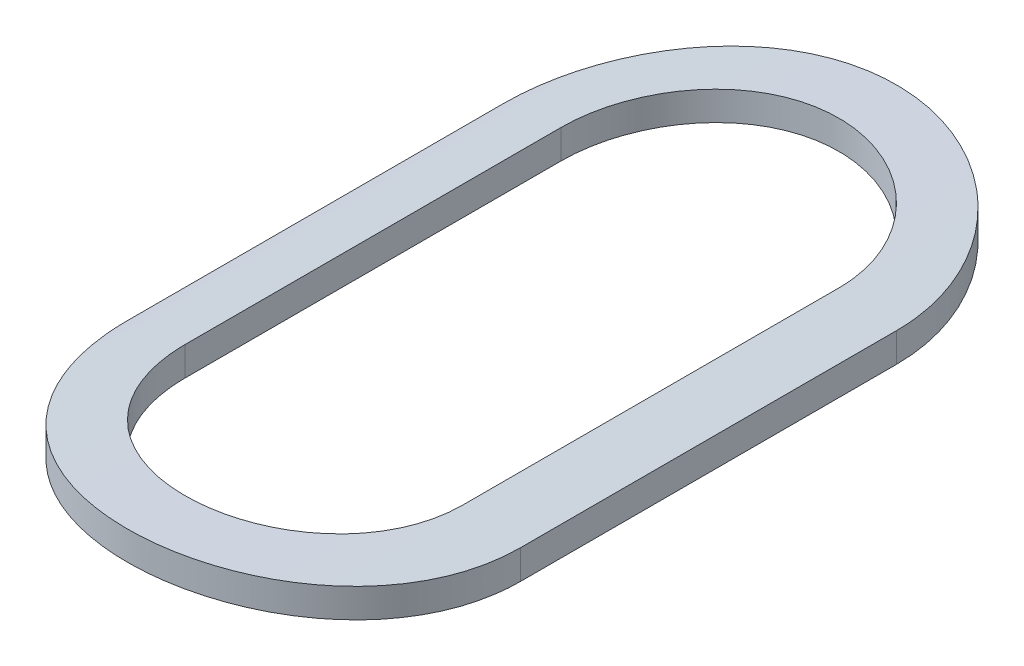
ISO-10303-21;
HEADER;
FILE_DESCRIPTION(('STEP AP214'),'2;1');
FILE_NAME('part.step','',(''),(''),'','','');
FILE_SCHEMA(('AUTOMOTIVE_DESIGN { 1 0 10303 214 1 1 1 1 }'));
ENDSEC;
DATA;
#1=APPLICATION_CONTEXT('core data for automotive mechanical design processes');
#2=APPLICATION_PROTOCOL_DEFINITION('international standard','automotive_design',2000,#1);
#3=PRODUCT_CONTEXT('',#1,'mechanical');
#4=PRODUCT('Part','Part','',(#3));
#5=PRODUCT_RELATED_PRODUCT_CATEGORY('part','',(#4));
#6=PRODUCT_DEFINITION_FORMATION('','',#4);
#7=PRODUCT_DEFINITION_CONTEXT('part definition',#1,'design');
#8=PRODUCT_DEFINITION('design','',#6,#7);
#9=PRODUCT_DEFINITION_SHAPE('','',#8);
#10=(LENGTH_UNIT() NAMED_UNIT(*) SI_UNIT(.MILLI.,.METRE.));
#11=(NAMED_UNIT(*) PLANE_ANGLE_UNIT() SI_UNIT($,.RADIAN.));
#12=(NAMED_UNIT(*) SI_UNIT($,.STERADIAN.) SOLID_ANGLE_UNIT());
#13=UNCERTAINTY_MEASURE_WITH_UNIT(LENGTH_MEASURE(1.E-05),#10,'distance_accuracy_value','');
#14=(GEOMETRIC_REPRESENTATION_CONTEXT(3) GLOBAL_UNCERTAINTY_ASSIGNED_CONTEXT((#13)) GLOBAL_UNIT_ASSIGNED_CONTEXT((#10,
#11,#12)) REPRESENTATION_CONTEXT('',''));
#15=CARTESIAN_POINT('',(0.,0.,0.));
#16=DIRECTION('',(0.,0.,1.));
#17=DIRECTION('',(1.,0.,0.));
#18=AXIS2_PLACEMENT_3D('',#15,#16,#17);
#19=CARTESIAN_POINT('',(-205.237767720161,-97.4477839792411,1.93657000024672));
#20=DIRECTION('',(0.,0.,1.));
#21=DIRECTION('',(1.,0.,0.));
#22=AXIS2_PLACEMENT_3D('',#19,#20,#21);
#23=CYLINDRICAL_SURFACE('',#22,5.00000000000003);
#24=CARTESIAN_POINT('',(-205.816025312001,-92.4813347287726,-3.24229252294943));
#25=CARTESIAN_POINT('',(-205.81605345322,-92.4813470455981,-3.27470870328744));
#26=CARTESIAN_POINT('',(-205.813301256707,-92.4810176953498,-3.3071141684369));
#27=CARTESIAN_POINT('',(-205.802446677341,-92.4797671542148,-3.37097244911429));
#28=CARTESIAN_POINT('',(-205.794349708049,-92.4788465622047,-3.40242619493164));
#29=CARTESIAN_POINT('',(-205.773011592033,-92.4765042816047,-3.46352962042139));
#30=CARTESIAN_POINT('',(-205.759768660538,-92.4750824191753,-3.49317867004024));
#31=CARTESIAN_POINT('',(-205.728529674045,-92.4719021558279,-3.54983156341706));
#32=CARTESIAN_POINT('',(-205.710534070537,-92.4701437868815,-3.57683565810423));
#33=CARTESIAN_POINT('',(-205.670207756246,-92.4664783744416,-3.62756102105008));
#34=CARTESIAN_POINT('',(-205.647859171863,-92.4645707380577,-3.65126803884867));
#35=CARTESIAN_POINT('',(-205.599497501548,-92.460827112354,-3.69460636258601));
#36=CARTESIAN_POINT('',(-205.573483858366,-92.4589911339836,-3.71423704761924));
#37=CARTESIAN_POINT('',(-205.518441967116,-92.4555917582716,-3.74891341290162));
#38=CARTESIAN_POINT('',(-205.489405485113,-92.4540291382538,-3.76394610616437));
#39=CARTESIAN_POINT('',(-205.429200909222,-92.4513592357457,-3.78891582297537));
#40=CARTESIAN_POINT('',(-205.398033010825,-92.4502519115612,-3.79885331314229));
#41=CARTESIAN_POINT('',(-205.334596648131,-92.4486214638352,-3.81330876046693));
#42=CARTESIAN_POINT('',(-205.302333729771,-92.4480957495245,-3.8178507584623));
#43=CARTESIAN_POINT('',(-205.237498790808,-92.4476789168199,-3.82146077224403));
#44=CARTESIAN_POINT('',(-205.204926773204,-92.4477877922755,-3.82052884108345));
#45=CARTESIAN_POINT('',(-205.140563410856,-92.4486257894006,-3.81323661881068));
#46=CARTESIAN_POINT('',(-205.108769075323,-92.4493519393145,-3.80690233585539));
#47=CARTESIAN_POINT('',(-205.046697948224,-92.4513395212461,-3.78902585126199));
#48=CARTESIAN_POINT('',(-205.016421173954,-92.4526009593627,-3.77748359028475));
#49=CARTESIAN_POINT('',(-204.958162773233,-92.4555225006161,-3.74949052704908));
#50=CARTESIAN_POINT('',(-204.930186698027,-92.4571835321094,-3.73302827249482));
#51=CARTESIAN_POINT('',(-204.87738579882,-92.4607180906581,-3.69567163655666));
#52=CARTESIAN_POINT('',(-204.852560962508,-92.4625916168832,-3.67477727249001));
#53=CARTESIAN_POINT('',(-204.806616299284,-92.4663540775476,-3.62900660598587));
#54=CARTESIAN_POINT('',(-204.785518493568,-92.4682430387985,-3.6041081951848));
#55=CARTESIAN_POINT('',(-204.747792196947,-92.4718132541877,-3.55110334086047));
#56=CARTESIAN_POINT('',(-204.731165046413,-92.473494445952,-3.5229959388226));
#57=CARTESIAN_POINT('',(-204.702849827051,-92.4764596597479,-3.46434379804804));
#58=CARTESIAN_POINT('',(-204.691166312109,-92.4777433152941,-3.43379684274049));
#59=CARTESIAN_POINT('',(-204.67312304922,-92.479759834021,-3.37119346196275));
#60=CARTESIAN_POINT('',(-204.666755270332,-92.4804935279044,-3.33913939110432));
#61=CARTESIAN_POINT('',(-204.660710580302,-92.4811955947182,-3.28537380442096));
#62=CARTESIAN_POINT('',(-204.659499727931,-92.4813388156744,-3.2638280558826));
#63=CARTESIAN_POINT('',(-204.659510128705,-92.4813347287279,-3.24229252294943));
#64=B_SPLINE_CURVE_WITH_KNOTS('',3,(#24,#25,#26,#27,#28,#29,#30,#31,#32,#33,#34,#35,#36,#37,#38,
#39,#40,#41,#42,#43,#44,#45,#46,#47,#48,#49,#50,#51,#52,#53,#54,#55,#56,#57,#58,#59,#60,#61,#62,
#63),.UNSPECIFIED.,.F.,.F.,(4,2,2,2,2,2,2,2,2,2,2,2,2,2,2,2,2,2,2,4),(0.,0.0971144596016323,
0.194130705508774,0.291180629617421,0.388221337577801,0.485669235955009,0.583131966690333,
0.680867490696617,0.778594062484607,0.875883538275932,0.973172071143984,1.06999486157763,
1.16681875522746,1.2638698053772,1.36092047633352,1.4585266740161,1.55616210298787,
1.65388727516014,1.75146453691094,1.81606442695371),.UNSPECIFIED.);
#65=CARTESIAN_POINT('',(-205.816025312001,-92.4813347287725,-3.24229252294943));
#66=VERTEX_POINT('',#65);
#67=CARTESIAN_POINT('',(-204.659510128705,-92.4813347287279,-3.24229252294943));
#68=VERTEX_POINT('',#67);
#69=EDGE_CURVE('E173',#66,#68,#64,.T.);
#70=ORIENTED_EDGE('',*,*,#69,.T.);
#71=DIRECTION('',(0.,0.,1.));
#72=VECTOR('',#71,1.);
#73=CARTESIAN_POINT('',(-204.659510128705,-92.4813347287279,-3.24229252294943));
#74=LINE('',#73,#72);
#75=CARTESIAN_POINT('',(-204.659510128705,-92.4813347287279,-1.67728344457965));
#76=VERTEX_POINT('',#75);
#77=EDGE_CURVE('E111',#76,#68,#74,.F.);
#78=ORIENTED_EDGE('',*,*,#77,.F.);
#79=CARTESIAN_POINT('',(-204.659510128705,-92.4813347287279,-1.67728344457965));
#80=CARTESIAN_POINT('',(-204.65948198318,-92.4813470453749,-1.64486736138544));
#81=CARTESIAN_POINT('',(-204.66223416535,-92.4810176971892,-1.61246199314019));
#82=CARTESIAN_POINT('',(-204.673088717127,-92.4797671597198,-1.5486037070112));
#83=CARTESIAN_POINT('',(-204.681185705116,-92.4788465657793,-1.51714986433027));
#84=CARTESIAN_POINT('',(-204.702524070631,-92.4765042566045,-1.45604569864241));
#85=CARTESIAN_POINT('',(-204.715767326654,-92.4750823584012,-1.42639603877623));
#86=CARTESIAN_POINT('',(-204.747006549714,-92.4719020810574,-1.3697432515192));
#87=CARTESIAN_POINT('',(-204.765001863621,-92.4701437481661,-1.34273976113284));
#88=CARTESIAN_POINT('',(-204.805325364428,-92.4664785790867,-1.29201779207971));
#89=CARTESIAN_POINT('',(-204.827671036202,-92.4645711628689,-1.26831325482106));
#90=CARTESIAN_POINT('',(-204.876032349208,-92.4608275253215,-1.22497397730186));
#91=CARTESIAN_POINT('',(-204.902049364491,-92.4589913309773,-1.20534076761731));
#92=CARTESIAN_POINT('',(-204.957107529511,-92.4555908299197,-1.17065324748614));
#93=CARTESIAN_POINT('',(-204.986158174165,-92.4540274204009,-1.15561392907279));
#94=CARTESIAN_POINT('',(-205.046371666948,-92.4513580548523,-1.1306489714965));
#95=CARTESIAN_POINT('',(-205.077531998354,-92.4502515645608,-1.12071735669542));
#96=CARTESIAN_POINT('',(-205.130346152671,-92.4488934431359,-1.1086800311415));
#97=CARTESIAN_POINT('',(-205.151664012772,-92.4484793797971,-1.10506483473564));
#98=CARTESIAN_POINT('',(-205.194574057236,-92.4479245041211,-1.10023726373121));
#99=CARTESIAN_POINT('',(-205.216166245618,-92.4477836957932,-1.09902492438868));
#100=CARTESIAN_POINT('',(-205.270132833281,-92.4477844039261,-1.09902724415101));
#101=CARTESIAN_POINT('',(-205.302518792684,-92.448101558574,-1.1017522405572));
#102=CARTESIAN_POINT('',(-205.36639046982,-92.449336246177,-1.11258048945385));
#103=CARTESIAN_POINT('',(-205.397875198235,-92.4502544143552,-1.12068943247351));
#104=CARTESIAN_POINT('',(-205.459010687186,-92.4525875978119,-1.14204449856265));
#105=CARTESIAN_POINT('',(-205.488662624789,-92.4540022902267,-1.1552872839462));
#106=CARTESIAN_POINT('',(-205.545317635545,-92.4571708752444,-1.18652753654787));
#107=CARTESIAN_POINT('',(-205.572321144898,-92.4589247118479,-1.20452421898137));
#108=CARTESIAN_POINT('',(-205.623045523049,-92.4625847434808,-1.2448518660794));
#109=CARTESIAN_POINT('',(-205.646752120136,-92.4644915478026,-1.26720072713355));
#110=CARTESIAN_POINT('',(-205.690087991771,-92.4682377457699,-1.31556202071159));
#111=CARTESIAN_POINT('',(-205.709716908808,-92.4700771334931,-1.34157477413166));
#112=CARTESIAN_POINT('',(-205.744395340358,-92.4734866329095,-1.39661981559408));
#113=CARTESIAN_POINT('',(-205.759430426865,-92.4750558895899,-1.42566124048833));
#114=CARTESIAN_POINT('',(-205.784398136002,-92.4777383200303,-1.48587384864351));
#115=CARTESIAN_POINT('',(-205.794333600315,-92.4788517477236,-1.51704383480186));
#116=CARTESIAN_POINT('',(-205.806375173798,-92.4802182866102,-1.56988157809097));
#117=CARTESIAN_POINT('',(-205.809991257807,-92.4806348583557,-1.59121323535459));
#118=CARTESIAN_POINT('',(-205.81481628588,-92.4811939415349,-1.63412129934431));
#119=CARTESIAN_POINT('',(-205.816028473882,-92.4813368222921,-1.65569733666955));
#120=CARTESIAN_POINT('',(-205.816025312001,-92.4813347287726,-1.67728344457965));
#121=B_SPLINE_CURVE_WITH_KNOTS('',3,(#79,#80,#81,#82,#83,#84,#85,#86,#87,#88,#89,#90,#91,#92,
#93,#94,#95,#96,#97,#98,#99,#100,#101,#102,#103,#104,#105,#106,#107,#108,#109,#110,#111,#112,
#113,#114,#115,#116,#117,#118,#119,#120),.UNSPECIFIED.,.F.,.F.,(4,2,2,2,2,2,2,2,2,2,2,2,2,2,2,2,
2,2,2,2,4),(0.,0.0971141698560025,0.194130705514868,0.291182687565284,0.388221337553571,
0.485658369900075,0.583131966607678,0.680920348294416,0.778594063001649,0.843344867671634,
0.908096622394173,1.00511304740933,1.10223217692016,1.19928827157682,1.29632835398478,
1.3937762336066,1.49123265335908,1.58899208404564,1.68669698057033,1.75148885975864,
1.81619324588167),.UNSPECIFIED.);
#122=CARTESIAN_POINT('',(-205.816025312001,-92.4813347287725,-1.67728344457965));
#123=VERTEX_POINT('',#122);
#124=EDGE_CURVE('E118',#76,#123,#121,.T.);
#125=ORIENTED_EDGE('',*,*,#124,.T.);
#126=DIRECTION('',(0.,0.,-1.));
#127=VECTOR('',#126,1.);
#128=CARTESIAN_POINT('',(-205.816025312001,-92.4813347287725,-1.67728344457965));
#129=LINE('',#128,#127);
#130=EDGE_CURVE('E115',#66,#123,#129,.F.);
#131=ORIENTED_EDGE('',*,*,#130,.F.);
#132=EDGE_LOOP('',(#70,#78,#125,#131));
#133=FACE_BOUND('',#132,.T.);
#134=DIRECTION('',(0.,0.,1.));
#135=VECTOR('',#134,1.);
#136=CARTESIAN_POINT('',(-206.056025312001,-92.5151929244914,-3.24229259979271));
#137=LINE('',#136,#135);
#138=CARTESIAN_POINT('',(-206.056025312001,-92.5151929244914,-1.67728329237749));
#139=VERTEX_POINT('',#138);
#140=CARTESIAN_POINT('',(-206.056025312001,-92.5151929244914,-3.24229254216025));
#141=VERTEX_POINT('',#140);
#142=EDGE_CURVE('E98',#139,#141,#137,.F.);
#143=ORIENTED_EDGE('',*,*,#142,.F.);
#144=CARTESIAN_POINT('',(-204.419510128705,-92.5151929244278,-1.67728340615801));
#145=CARTESIAN_POINT('',(-204.419469583894,-92.5152177455033,-1.63157671461435));
#146=CARTESIAN_POINT('',(-204.423337202401,-92.514558298794,-1.58588872337746));
#147=CARTESIAN_POINT('',(-204.438581215502,-92.5120563218705,-1.49587402543486));
#148=CARTESIAN_POINT('',(-204.449947946265,-92.5102153143735,-1.45154564348575));
#149=CARTESIAN_POINT('',(-204.479887760545,-92.505534208199,-1.36543936313904));
#150=CARTESIAN_POINT('',(-204.498462619333,-92.5026938634135,-1.32366209598479));
#151=CARTESIAN_POINT('',(-204.542264858439,-92.496343081097,-1.24381645331873));
#152=CARTESIAN_POINT('',(-204.567492006978,-92.4928326669135,-1.20574794865007));
#153=CARTESIAN_POINT('',(-204.624135409762,-92.4854987717767,-1.1340469068649));
#154=CARTESIAN_POINT('',(-204.65560135479,-92.481672931592,-1.10045386273409));
#155=CARTESIAN_POINT('',(-204.723733811126,-92.4741593685713,-1.03898879296281));
#156=CARTESIAN_POINT('',(-204.760402239161,-92.4704716972759,-1.01111888517504));
#157=CARTESIAN_POINT('',(-204.838163315761,-92.4636242885595,-0.961744037048654));
#158=CARTESIAN_POINT('',(-204.879281807311,-92.4604679404276,-0.940279330690012));
#159=CARTESIAN_POINT('',(-204.964570477406,-92.4550711398516,-0.904599397207698));
#160=CARTESIAN_POINT('',(-205.008736994849,-92.4528296102206,-0.890375639049163));
#161=CARTESIAN_POINT('',(-205.083910694341,-92.4500602914303,-0.873024747982653));
#162=CARTESIAN_POINT('',(-205.114434780676,-92.4492108397193,-0.867783010909644));
#163=CARTESIAN_POINT('',(-205.175890775964,-92.4480724009212,-0.860782880708866));
#164=CARTESIAN_POINT('',(-205.206822688049,-92.4477834181408,-0.859024514347178));
#165=CARTESIAN_POINT('',(-205.283398607863,-92.4477848066276,-0.859027826779499));
#166=CARTESIAN_POINT('',(-205.329058023749,-92.448415213171,-0.862856072326133));
#167=CARTESIAN_POINT('',(-205.419099966746,-92.450869588219,-0.878063117611092));
#168=CARTESIAN_POINT('',(-205.463481130311,-92.4526947853451,-0.889449689861891));
#169=CARTESIAN_POINT('',(-205.549646007249,-92.4573338703443,-0.919420878786187));
#170=CARTESIAN_POINT('',(-205.591431903344,-92.4601469137761,-0.937999348989048));
#171=CARTESIAN_POINT('',(-205.671287461548,-92.4664521176568,-0.981812015851009));
#172=CARTESIAN_POINT('',(-205.709357582195,-92.4699441941514,-1.00704538984818));
#173=CARTESIAN_POINT('',(-205.781057576196,-92.4772560952725,-1.06369859729846));
#174=CARTESIAN_POINT('',(-205.814648260083,-92.481078384344,-1.09516771320179));
#175=CARTESIAN_POINT('',(-205.876098923618,-92.4886011796767,-1.16329591219565));
#176=CARTESIAN_POINT('',(-205.903958316683,-92.4923016734399,-1.19995552587185));
#177=CARTESIAN_POINT('',(-205.953315865383,-92.4991864135317,-1.27769626880885));
#178=CARTESIAN_POINT('',(-205.974773689082,-92.5023673318523,-1.31880329656286));
#179=CARTESIAN_POINT('',(-206.010454954267,-92.5078161409318,-1.40409248950751));
#180=CARTESIAN_POINT('',(-206.024682761172,-92.510084582463,-1.4482727807238));
#181=CARTESIAN_POINT('',(-206.042035603347,-92.5128875242913,-1.52347378731533));
#182=CARTESIAN_POINT('',(-206.047276741209,-92.5137474123375,-1.55401085983555));
#183=CARTESIAN_POINT('',(-206.054272095082,-92.5149020576824,-1.61545503047784));
#184=CARTESIAN_POINT('',(-206.056030475274,-92.5151974898613,-1.64636164220029));
#185=CARTESIAN_POINT('',(-206.056025312001,-92.5151929244915,-1.67728329237749));
#186=B_SPLINE_CURVE_WITH_KNOTS('',3,(#144,#145,#146,#147,#148,#149,#150,#151,#152,#153,#154,
#155,#156,#157,#158,#159,#160,#161,#162,#163,#164,#165,#166,#167,#168,#169,#170,#171,#172,#173,
#174,#175,#176,#177,#178,#179,#180,#181,#182,#183,#184,#185),.UNSPECIFIED.,.F.,.F.,(4,2,2,2,2,2,
2,2,2,2,2,2,2,2,2,2,2,2,2,2,4),(0.,0.136923950960336,0.273671796791202,0.410453343293117,
0.547230124703333,0.685143554436087,0.823107927577569,0.961921508066535,1.10057116248186,
1.19332857538335,1.28608670102632,1.42286586335766,1.55978589921434,1.69658917540752,
1.83337554825505,1.97128949854092,2.10921755692803,2.24799709478117,2.38669273896362,
2.47948852703614,2.57217329610048),.UNSPECIFIED.);
#187=CARTESIAN_POINT('',(-204.419510128705,-92.5151929244278,-1.67728342536883));
#188=VERTEX_POINT('',#187);
#189=EDGE_CURVE('E21',#188,#139,#186,.T.);
#190=ORIENTED_EDGE('',*,*,#189,.F.);
#191=DIRECTION('',(0.,0.,-1.));
#192=VECTOR('',#191,1.);
#193=CARTESIAN_POINT('',(-204.419510128705,-92.5151929244278,-1.67728336773636));
#194=LINE('',#193,#192);
#195=CARTESIAN_POINT('',(-204.419510128705,-92.5151929244278,-3.2422927087477));
#196=VERTEX_POINT('',#195);
#197=EDGE_CURVE('E85',#196,#188,#194,.F.);
#198=ORIENTED_EDGE('',*,*,#197,.F.);
#199=CARTESIAN_POINT('',(-206.056025312001,-92.5151929244915,-3.24229256137107));
#200=CARTESIAN_POINT('',(-206.056065850808,-92.515217745583,-3.28799936103745));
#201=CARTESIAN_POINT('',(-206.052198216996,-92.5145582957453,-3.33368746018584));
#202=CARTESIAN_POINT('',(-206.036954174544,-92.5120563133006,-3.42370215208156));
#203=CARTESIAN_POINT('',(-206.025587465142,-92.5102153089893,-3.4680304262147));
#204=CARTESIAN_POINT('',(-205.995647976741,-92.505534255493,-3.55413573352105));
#205=CARTESIAN_POINT('',(-205.977073551117,-92.502693978035,-3.59591218119567));
#206=CARTESIAN_POINT('',(-205.933271629356,-92.4963432223219,-3.67575796548045));
#207=CARTESIAN_POINT('',(-205.908044096061,-92.4928327403238,-3.71382728138408));
#208=CARTESIAN_POINT('',(-205.851396862148,-92.485498374046,-3.78553297007385));
#209=CARTESIAN_POINT('',(-205.819926933647,-92.4816721051632,-3.81912942547699));
#210=CARTESIAN_POINT('',(-205.751793995122,-92.4741585643196,-3.88059319327815));
#211=CARTESIAN_POINT('',(-205.715130190961,-92.4704713137239,-3.9084596279633));
#212=CARTESIAN_POINT('',(-205.637391631918,-92.463626125481,-3.9578189067592));
#213=CARTESIAN_POINT('',(-205.596292805583,-92.4604713419292,-3.97927431444965));
#214=CARTESIAN_POINT('',(-205.511016664348,-92.4550734914938,-4.01496086351699));
#215=CARTESIAN_POINT('',(-205.466839718733,-92.4528303154637,-4.02919286979961));
#216=CARTESIAN_POINT('',(-205.377075908382,-92.4495251357669,-4.04990719725862));
#217=CARTESIAN_POINT('',(-205.331505067711,-92.4484528095476,-4.05645728318314));
#218=CARTESIAN_POINT('',(-205.239898318281,-92.4475746926404,-4.0618325347742));
#219=CARTESIAN_POINT('',(-205.193862429081,-92.4477688489088,-4.06065802396802));
#220=CARTESIAN_POINT('',(-205.103097894796,-92.4493936818346,-4.05067010545805));
#221=CARTESIAN_POINT('',(-205.058360960137,-92.4508125204654,-4.04192982768266));
#222=CARTESIAN_POINT('',(-204.970997657123,-92.4547140846072,-4.01717361677127));
#223=CARTESIAN_POINT('',(-204.928371337958,-92.4571968349013,-4.00115751414866));
#224=CARTESIAN_POINT('',(-204.84622004591,-92.4629674986844,-3.96223090490676));
#225=CARTESIAN_POINT('',(-204.806709726253,-92.4662589478132,-3.93929001958355));
#226=CARTESIAN_POINT('',(-204.732073401851,-92.4732809318163,-3.88718811073485));
#227=CARTESIAN_POINT('',(-204.696947574812,-92.4770114844759,-3.85802683522321));
#228=CARTESIAN_POINT('',(-204.631648055881,-92.484547753114,-3.79391046905772));
#229=CARTESIAN_POINT('',(-204.60153640729,-92.4883538392547,-3.75889220769625));
#230=CARTESIAN_POINT('',(-204.547597917773,-92.4955714661168,-3.68425531680975));
#231=CARTESIAN_POINT('',(-204.523772874036,-92.4989828938587,-3.64463537642766));
#232=CARTESIAN_POINT('',(-204.483072318769,-92.5050255837505,-3.56184364433175));
#233=CARTESIAN_POINT('',(-204.46620814016,-92.5076555717108,-3.51866619667673));
#234=CARTESIAN_POINT('',(-204.440013102122,-92.5118173602202,-3.43006851099552));
#235=CARTESIAN_POINT('',(-204.430670974507,-92.5133508030295,-3.38465173625472));
#236=CARTESIAN_POINT('',(-204.4233185101,-92.5145624854378,-3.32279133353801));
#237=CARTESIAN_POINT('',(-204.421889767019,-92.5147986920222,-3.30671145154322));
#238=CARTESIAN_POINT('',(-204.419986824293,-92.5151137500438,-3.27452095444589));
#239=CARTESIAN_POINT('',(-204.419511019327,-92.515192866114,-3.25841043686994));
#240=CARTESIAN_POINT('',(-204.419510128705,-92.5151929244277,-3.2422927087477));
#241=B_SPLINE_CURVE_WITH_KNOTS('',3,(#199,#200,#201,#202,#203,#204,#205,#206,#207,#208,#209,
#210,#211,#212,#213,#214,#215,#216,#217,#218,#219,#220,#221,#222,#223,#224,#225,#226,#227,#228,
#229,#230,#231,#232,#233,#234,#235,#236,#237,#238,#239,#240),.UNSPECIFIED.,.F.,.F.,(4,2,2,2,2,2,
2,2,2,2,2,2,2,2,2,2,2,2,2,2,4),(0.,0.136924273568553,0.273671796779466,0.410450578793856,
0.547230124755249,0.685158470322037,0.823107927758303,0.961847852289615,1.10057116064878,
1.2380613144129,1.37554570974907,1.51171584881383,1.64788916005504,1.78466876048583,
1.92145390287001,2.05982271657082,2.19823104382084,2.33686383193083,2.47528855687436,
2.52370175778949,2.57203333292965),.UNSPECIFIED.);
#242=EDGE_CURVE('E99',#141,#196,#241,.T.);
#243=ORIENTED_EDGE('',*,*,#242,.F.);
#244=EDGE_LOOP('',(#143,#190,#198,#243));
#245=FACE_BOUND('',#244,.T.);
#246=ADVANCED_FACE('F17',(#133,#245),#23,.T.);
#247=CARTESIAN_POINT('',(-206.056025312001,-90.5682667595488,-3.24229259979271));
#248=DIRECTION('',(-1.,0.,0.));
#249=DIRECTION('',(0.,0.,1.));
#250=AXIS2_PLACEMENT_3D('',#247,#248,#249);
#251=PLANE('',#250);
#252=ORIENTED_EDGE('',*,*,#142,.T.);
#253=DIRECTION('',(0.,1.,0.));
#254=VECTOR('',#253,1.);
#255=CARTESIAN_POINT('',(-206.056025312001,-90.5682667595488,-3.24229256137107));
#256=LINE('',#255,#254);
#257=CARTESIAN_POINT('',(-206.056025312001,-92.6368740327345,-3.24229254216025));
#258=VERTEX_POINT('',#257);
#259=EDGE_CURVE('E168',#258,#141,#256,.T.);
#260=ORIENTED_EDGE('',*,*,#259,.F.);
#261=DIRECTION('',(0.,0.,1.));
#262=VECTOR('',#261,1.);
#263=CARTESIAN_POINT('',(-206.056025312001,-92.6368740327345,1.93657000024672));
#264=LINE('',#263,#262);
#265=CARTESIAN_POINT('',(-206.056025312001,-92.6368740327345,-1.67728329237749));
#266=VERTEX_POINT('',#265);
#267=EDGE_CURVE('E106',#258,#266,#264,.T.);
#268=ORIENTED_EDGE('',*,*,#267,.T.);
#269=DIRECTION('',(0.,1.,0.));
#270=VECTOR('',#269,1.);
#271=CARTESIAN_POINT('',(-206.056025312001,-90.5682667595488,-1.67728329237749));
#272=LINE('',#271,#270);
#273=EDGE_CURVE('E93',#139,#266,#272,.F.);
#274=ORIENTED_EDGE('',*,*,#273,.F.);
#275=EDGE_LOOP('',(#252,#260,#268,#274));
#276=FACE_BOUND('',#275,.T.);
#277=ADVANCED_FACE('F105',(#276),#251,.T.);
#278=CARTESIAN_POINT('',(-205.237767720353,-90.5682667595488,-1.67728344457965));
#279=DIRECTION('',(0.,1.,0.));
#280=DIRECTION('',(0.,0.,1.));
#281=AXIS2_PLACEMENT_3D('',#278,#279,#280);
#282=CYLINDRICAL_SURFACE('',#281,0.818257591648157);
#283=DIRECTION('',(0.,1.,0.));
#284=VECTOR('',#283,1.);
#285=CARTESIAN_POINT('',(-204.419510128705,-90.5682667595488,-1.67728340615801));
#286=LINE('',#285,#284);
#287=CARTESIAN_POINT('',(-204.419510128705,-92.6368740326692,-1.67728342536883));
#288=VERTEX_POINT('',#287);
#289=EDGE_CURVE('E95',#188,#288,#286,.F.);
#290=ORIENTED_EDGE('',*,*,#289,.F.);
#291=ORIENTED_EDGE('',*,*,#189,.T.);
#292=ORIENTED_EDGE('',*,*,#273,.T.);
#293=CARTESIAN_POINT('',(-206.056025312001,-92.6368740327345,-1.67728329237749));
#294=CARTESIAN_POINT('',(-206.056065921352,-92.6368994793883,-1.63159288300411));
#295=CARTESIAN_POINT('',(-206.052200966113,-92.6362238161791,-1.58592152870158));
#296=CARTESIAN_POINT('',(-206.036968439681,-92.6336605145276,-1.49594144915533));
#297=CARTESIAN_POINT('',(-206.025610733758,-92.6317744698129,-1.4516310122468));
#298=CARTESIAN_POINT('',(-205.995696237809,-92.6269791620225,-1.36556047549024));
#299=CARTESIAN_POINT('',(-205.977137759895,-92.6240696590593,-1.32380097624985));
#300=CARTESIAN_POINT('',(-205.933375508098,-92.6175644569927,-1.24398730338477));
#301=CARTESIAN_POINT('',(-205.908171898375,-92.613968774841,-1.20593303825894));
#302=CARTESIAN_POINT('',(-205.851569911574,-92.6064550500433,-1.13423939588093));
#303=CARTESIAN_POINT('',(-205.820119377924,-92.6025344673586,-1.10064145826018));
#304=CARTESIAN_POINT('',(-205.752017050511,-92.5948343659367,-1.03916281256008));
#305=CARTESIAN_POINT('',(-205.715363342521,-92.5910548997649,-1.01128421787494));
#306=CARTESIAN_POINT('',(-205.637617200762,-92.5840351827162,-0.961880437026056));
#307=CARTESIAN_POINT('',(-205.59649765922,-92.5807985674395,-0.94039739503348));
#308=CARTESIAN_POINT('',(-205.511200595883,-92.5752637467863,-0.904682120892872));
#309=CARTESIAN_POINT('',(-205.467026745235,-92.5729644369773,-0.890441350205023));
#310=CARTESIAN_POINT('',(-205.39180925086,-92.5701219000218,-0.873058653032423));
#311=CARTESIAN_POINT('',(-205.361249460828,-92.569249467263,-0.867804263571939));
#312=CARTESIAN_POINT('',(-205.299720061526,-92.5680802177776,-0.86078718096267));
#313=CARTESIAN_POINT('',(-205.26875044941,-92.5677834050525,-0.85902451208683));
#314=CARTESIAN_POINT('',(-205.192153355237,-92.567784824591,-0.859027826991877));
#315=CARTESIAN_POINT('',(-205.146510558836,-92.5684302632369,-0.862853334596898));
#316=CARTESIAN_POINT('',(-205.056502147742,-92.5709431824667,-0.878048994866105));
#317=CARTESIAN_POINT('',(-205.012137892963,-92.5728119175024,-0.889426892436054));
#318=CARTESIAN_POINT('',(-204.926007053466,-92.5775617659709,-0.919373712802826));
#319=CARTESIAN_POINT('',(-204.88423823572,-92.580441994546,-0.937936351811251));
#320=CARTESIAN_POINT('',(-204.804413714789,-92.5868982541706,-0.981710219729127));
#321=CARTESIAN_POINT('',(-204.766357568201,-92.5904742019774,-1.00692065335916));
#322=CARTESIAN_POINT('',(-204.694665515389,-92.5979641700168,-1.06353301027062));
#323=CARTESIAN_POINT('',(-204.661070638303,-92.6018808441097,-1.09498654311014));
#324=CARTESIAN_POINT('',(-204.59960769215,-92.609590759877,-1.16308404107917));
#325=CARTESIAN_POINT('',(-204.571740218754,-92.6133839886781,-1.19972854542039));
#326=CARTESIAN_POINT('',(-204.522354353636,-92.6204438996072,-1.27745406751865));
#327=CARTESIAN_POINT('',(-204.500878322293,-92.6237070063014,-1.31856232359612));
#328=CARTESIAN_POINT('',(-204.465162052465,-92.6292977740442,-1.40386012438766));
#329=CARTESIAN_POINT('',(-204.450917412383,-92.6316260039523,-1.4480477760624));
#330=CARTESIAN_POINT('',(-204.433533272905,-92.6345047311212,-1.52329187592518));
#331=CARTESIAN_POINT('',(-204.428279714226,-92.6353884213789,-1.55386387791634));
#332=CARTESIAN_POINT('',(-204.421267581236,-92.636575088953,-1.6153803362378));
#333=CARTESIAN_POINT('',(-204.41950488892,-92.6368787504859,-1.64632431034545));
#334=CARTESIAN_POINT('',(-204.419510128705,-92.6368740326692,-1.67728340615801));
#335=B_SPLINE_CURVE_WITH_KNOTS('',3,(#293,#294,#295,#296,#297,#298,#299,#300,#301,#302,#303,
#304,#305,#306,#307,#308,#309,#310,#311,#312,#313,#314,#315,#316,#317,#318,#319,#320,#321,#322,
#323,#324,#325,#326,#327,#328,#329,#330,#331,#332,#333,#334),.UNSPECIFIED.,.F.,.F.,(4,2,2,2,2,2,
2,2,2,2,2,2,2,2,2,2,2,2,2,2,4),(0.,0.136874463677233,0.273569071422999,0.41029574027283,
0.547019031786762,0.684935848575094,0.822903536535389,0.96176121610933,1.10045480260568,
1.19332512698137,1.28619609694948,1.42292550916481,1.55979535319295,1.69654576010989,
1.83327981491468,1.97119518154854,2.10912488464851,2.24794936215898,2.38668923844876,
2.47959560857871,2.57239231615865),.UNSPECIFIED.);
#336=EDGE_CURVE('E150',#266,#288,#335,.T.);
#337=ORIENTED_EDGE('',*,*,#336,.T.);
#338=EDGE_LOOP('',(#290,#291,#292,#337));
#339=FACE_BOUND('',#338,.T.);
#340=ADVANCED_FACE('F91',(#339),#282,.T.);
#341=CARTESIAN_POINT('',(-204.419510128705,-90.5682667595488,-1.67728336773636));
#342=DIRECTION('',(1.,0.,0.));
#343=DIRECTION('',(0.,0.,-1.));
#344=AXIS2_PLACEMENT_3D('',#341,#342,#343);
#345=PLANE('',#344);
#346=ORIENTED_EDGE('',*,*,#197,.T.);
#347=ORIENTED_EDGE('',*,*,#289,.T.);
#348=DIRECTION('',(0.,0.,1.));
#349=VECTOR('',#348,1.);
#350=CARTESIAN_POINT('',(-204.419510128705,-92.6368740326692,1.93657000024672));
#351=LINE('',#350,#349);
#352=CARTESIAN_POINT('',(-204.419510128705,-92.6368740326692,-3.2422927087477));
#353=VERTEX_POINT('',#352);
#354=EDGE_CURVE('E149',#288,#353,#351,.F.);
#355=ORIENTED_EDGE('',*,*,#354,.T.);
#356=DIRECTION('',(0.,1.,0.));
#357=VECTOR('',#356,1.);
#358=CARTESIAN_POINT('',(-204.419510128705,-90.5682667595488,-3.2422927087477));
#359=LINE('',#358,#357);
#360=EDGE_CURVE('E114',#196,#353,#359,.F.);
#361=ORIENTED_EDGE('',*,*,#360,.F.);
#362=EDGE_LOOP('',(#346,#347,#355,#361));
#363=FACE_BOUND('',#362,.T.);
#364=ADVANCED_FACE('F161',(#363),#345,.T.);
#365=CARTESIAN_POINT('',(-205.237767720353,-90.5682667595488,-3.24229252294943));
#366=DIRECTION('',(0.,1.,0.));
#367=DIRECTION('',(0.,0.,1.));
#368=AXIS2_PLACEMENT_3D('',#365,#366,#367);
#369=CYLINDRICAL_SURFACE('',#368,0.818257591648161);
#370=ORIENTED_EDGE('',*,*,#360,.T.);
#371=CARTESIAN_POINT('',(-204.419510128705,-92.6368740326692,-3.2422927087477));
#372=CARTESIAN_POINT('',(-204.419469527225,-92.6368994790153,-3.28798322347876));
#373=CARTESIAN_POINT('',(-204.423334499175,-92.6362238123658,-3.33365468277295));
#374=CARTESIAN_POINT('',(-204.438567057757,-92.6336605046037,-3.42363475590563));
#375=CARTESIAN_POINT('',(-204.449924744654,-92.6317744627864,-3.46794508739405));
#376=CARTESIAN_POINT('',(-204.479838920958,-92.6269792080743,-3.55401465719861));
#377=CARTESIAN_POINT('',(-204.498396970002,-92.62406977352,-3.59577334054424));
#378=CARTESIAN_POINT('',(-204.542158909519,-92.6175645982258,-3.6755871524555));
#379=CARTESIAN_POINT('',(-204.567362903171,-92.6139688468309,-3.71364222350901));
#380=CARTESIAN_POINT('',(-204.623968709372,-92.6064546407439,-3.78534049509596));
#381=CARTESIAN_POINT('',(-204.65542321429,-92.6025336200587,-3.81894183288421));
#382=CARTESIAN_POINT('',(-204.723526024272,-92.5948335412902,-3.88041917856302));
#383=CARTESIAN_POINT('',(-204.760175124282,-92.5910545050476,-3.90829430854797));
#384=CARTESIAN_POINT('',(-204.837898801738,-92.584037059949,-3.95768253870296));
#385=CARTESIAN_POINT('',(-204.878998716773,-92.5808020462126,-3.97915628823715));
#386=CARTESIAN_POINT('',(-204.964283262063,-92.5752661529562,-4.01487816231766));
#387=CARTESIAN_POINT('',(-205.00846751354,-92.5729651589676,-4.02912717234395));
#388=CARTESIAN_POINT('',(-205.098231495951,-92.5695745579261,-4.04986742524174));
#389=CARTESIAN_POINT('',(-205.143794374454,-92.5684738560823,-4.05642976187402));
#390=CARTESIAN_POINT('',(-205.235387982224,-92.5675697244729,-4.06183151522282));
#391=CARTESIAN_POINT('',(-205.281418690319,-92.5677662362586,-4.06067127989559));
#392=CARTESIAN_POINT('',(-205.37215278697,-92.5694256607581,-4.05071594228891));
#393=CARTESIAN_POINT('',(-205.416864859033,-92.5708758478578,-4.04199755761579));
#394=CARTESIAN_POINT('',(-205.50418202949,-92.5748654685862,-4.017294284812));
#395=CARTESIAN_POINT('',(-205.546787076565,-92.5774049287311,-4.00130921978837));
#396=CARTESIAN_POINT('',(-205.62890970343,-92.5833094534524,-3.96244995041214));
#397=CARTESIAN_POINT('',(-205.668412004834,-92.5866783022803,-3.93954405635561));
#398=CARTESIAN_POINT('',(-205.743039629468,-92.5938672229189,-3.88751736689475));
#399=CARTESIAN_POINT('',(-205.778164756255,-92.597687314966,-3.85839629271735));
#400=CARTESIAN_POINT('',(-205.843491667654,-92.6054089823972,-3.79434496825167));
#401=CARTESIAN_POINT('',(-205.873628400287,-92.6093109837776,-3.7593483929151));
#402=CARTESIAN_POINT('',(-205.927621066643,-92.6167129150722,-3.68474916756867));
#403=CARTESIAN_POINT('',(-205.951475211383,-92.6202127303033,-3.64514521021267));
#404=CARTESIAN_POINT('',(-205.992238794717,-92.6264147834324,-3.56237389643248));
#405=CARTESIAN_POINT('',(-206.009136267758,-92.6291156448943,-3.51920055247255));
#406=CARTESIAN_POINT('',(-206.035397032701,-92.6333922732365,-3.43060237574343));
#407=CARTESIAN_POINT('',(-206.044771587227,-92.6349697215878,-3.3851810171474));
#408=CARTESIAN_POINT('',(-206.052175513482,-92.636220632103,-3.32322686569499));
#409=CARTESIAN_POINT('',(-206.053619786999,-92.6364654369652,-3.30706038831406));
#410=CARTESIAN_POINT('',(-206.055543430648,-92.6367919731673,-3.2746958202006));
#411=CARTESIAN_POINT('',(-206.056024423464,-92.6368739787471,-3.25849782871967));
#412=CARTESIAN_POINT('',(-206.056025312001,-92.6368740327345,-3.24229256137107));
#413=B_SPLINE_CURVE_WITH_KNOTS('',3,(#371,#372,#373,#374,#375,#376,#377,#378,#379,#380,#381,
#382,#383,#384,#385,#386,#387,#388,#389,#390,#391,#392,#393,#394,#395,#396,#397,#398,#399,#400,
#401,#402,#403,#404,#405,#406,#407,#408,#409,#410,#411,#412),.UNSPECIFIED.,.F.,.F.,(4,2,2,2,2,2,
2,2,2,2,2,2,2,2,2,2,2,2,2,2,4),(0.,0.136874778041383,0.273569071770026,0.410292990760095,
0.547019032550411,0.684950719683501,0.822903537865671,0.961687676693743,1.10045480171818,
1.23792807863378,1.37539516145217,1.51148303351676,1.64757421854905,1.78429824461452,
1.92102840453134,2.05942097460009,2.19785290982674,2.33652196465284,2.47498302754966,
2.52365902880849,2.57225296417636),.UNSPECIFIED.);
#414=EDGE_CURVE('E142',#353,#258,#413,.T.);
#415=ORIENTED_EDGE('',*,*,#414,.T.);
#416=ORIENTED_EDGE('',*,*,#259,.T.);
#417=ORIENTED_EDGE('',*,*,#242,.T.);
#418=EDGE_LOOP('',(#370,#415,#416,#417));
#419=FACE_BOUND('',#418,.T.);
#420=ADVANCED_FACE('F155',(#419),#369,.T.);
#421=CARTESIAN_POINT('',(-204.659510128705,-90.5682667595488,-3.24229252294943));
#422=DIRECTION('',(-1.,0.,0.));
#423=DIRECTION('',(0.,0.,1.));
#424=AXIS2_PLACEMENT_3D('',#421,#422,#423);
#425=PLANE('',#424);
#426=ORIENTED_EDGE('',*,*,#77,.T.);
#427=DIRECTION('',(0.,1.,0.));
#428=VECTOR('',#427,1.);
#429=CARTESIAN_POINT('',(-204.659510128705,-90.5682667595488,-3.24229252294943));
#430=LINE('',#429,#428);
#431=CARTESIAN_POINT('',(-204.659510128705,-92.6021655297629,-3.24229252294943));
#432=VERTEX_POINT('',#431);
#433=EDGE_CURVE('E211',#68,#432,#430,.F.);
#434=ORIENTED_EDGE('',*,*,#433,.T.);
#435=DIRECTION('',(0.,0.,1.));
#436=VECTOR('',#435,1.);
#437=CARTESIAN_POINT('',(-204.659510128705,-92.6021655297629,1.93657000024672));
#438=LINE('',#437,#436);
#439=CARTESIAN_POINT('',(-204.659510128705,-92.6021655297629,-1.67728344457965));
#440=VERTEX_POINT('',#439);
#441=EDGE_CURVE('E148',#432,#440,#438,.T.);
#442=ORIENTED_EDGE('',*,*,#441,.T.);
#443=DIRECTION('',(0.,1.,0.));
#444=VECTOR('',#443,1.);
#445=CARTESIAN_POINT('',(-204.659510128705,-90.5682667595488,-1.67728344457965));
#446=LINE('',#445,#444);
#447=EDGE_CURVE('E113',#440,#76,#446,.T.);
#448=ORIENTED_EDGE('',*,*,#447,.T.);
#449=EDGE_LOOP('',(#426,#434,#442,#448));
#450=FACE_BOUND('',#449,.T.);
#451=ADVANCED_FACE('F160',(#450),#425,.T.);
#452=CARTESIAN_POINT('',(-205.237767720353,-90.5682667595488,-1.67728344457965));
#453=DIRECTION('',(0.,1.,0.));
#454=DIRECTION('',(0.,0.,1.));
#455=AXIS2_PLACEMENT_3D('',#452,#453,#454);
#456=CYLINDRICAL_SURFACE('',#455,0.578257591648153);
#457=CARTESIAN_POINT('',(-204.659510128705,-92.6021655297629,-1.67728344457965));
#458=CARTESIAN_POINT('',(-204.659481957695,-92.602178153299,-1.64487308466334));
#459=CARTESIAN_POINT('',(-204.662233198427,-92.601840707234,-1.61247356318567));
#460=CARTESIAN_POINT('',(-204.673083692295,-92.6005594712664,-1.54862744613783));
#461=CARTESIAN_POINT('',(-204.681177491197,-92.5996162997775,-1.51717991288806));
#462=CARTESIAN_POINT('',(-204.702506907944,-92.5972166227029,-1.45608830841874));
#463=CARTESIAN_POINT('',(-204.715744373165,-92.5957599327018,-1.42644488958578));
#464=CARTESIAN_POINT('',(-204.746969457657,-92.5925018903091,-1.36980331287257));
#465=CARTESIAN_POINT('',(-204.764956448485,-92.5907005835248,-1.34280480567288));
#466=CARTESIAN_POINT('',(-204.805265366014,-92.5869454143583,-1.29208533071314));
#467=CARTESIAN_POINT('',(-204.827605658019,-92.5849909274029,-1.26837900399296));
#468=CARTESIAN_POINT('',(-204.87595648471,-92.581154785793,-1.22503482303537));
#469=CARTESIAN_POINT('',(-204.901968392402,-92.5792731587216,-1.20539849759356));
#470=CARTESIAN_POINT('',(-204.957021402263,-92.5757880639015,-1.17070078857195));
#471=CARTESIAN_POINT('',(-204.986072425493,-92.5741855557436,-1.15565505889897));
#472=CARTESIAN_POINT('',(-205.046288867268,-92.571449239681,-1.13067775108521));
#473=CARTESIAN_POINT('',(-205.07745176562,-92.5703148841888,-1.12074019466852));
#474=CARTESIAN_POINT('',(-205.130281320059,-92.5689221061355,-1.10869179239042));
#475=CARTESIAN_POINT('',(-205.151611741019,-92.568497347719,-1.10507220606508));
#476=CARTESIAN_POINT('',(-205.194547583473,-92.5679281371298,-1.10023875435239));
#477=CARTESIAN_POINT('',(-205.216153008906,-92.5677836889769,-1.09902492346594));
#478=CARTESIAN_POINT('',(-205.270126942272,-92.5677844137934,-1.09902724442739));
#479=CARTESIAN_POINT('',(-205.302506976806,-92.5681092485172,-1.10175126115666));
#480=CARTESIAN_POINT('',(-205.366366696547,-92.5693738397822,-1.11257543381663));
#481=CARTESIAN_POINT('',(-205.397845393709,-92.5703142460597,-1.12068127039234));
#482=CARTESIAN_POINT('',(-205.45896873588,-92.5727039657535,-1.14202760073075));
#483=CARTESIAN_POINT('',(-205.488614576455,-92.5741529432218,-1.15526470552149));
#484=CARTESIAN_POINT('',(-205.545258536865,-92.5773984387854,-1.18649104009035));
#485=CARTESIAN_POINT('',(-205.572257087131,-92.5791949002407,-1.20447949556935));
#486=CARTESIAN_POINT('',(-205.62297884775,-92.5829445142876,-1.24479264157439));
#487=CARTESIAN_POINT('',(-205.646687104412,-92.5848983223227,-1.26713608647169));
#488=CARTESIAN_POINT('',(-205.69002764995,-92.5887372053421,-1.31548678987813));
#489=CARTESIAN_POINT('',(-205.70965957881,-92.5906222742433,-1.3414943716589));
#490=CARTESIAN_POINT('',(-205.7443480993,-92.5941170846556,-1.39653422731016));
#491=CARTESIAN_POINT('',(-205.75938957871,-92.5957259093007,-1.42557607798161));
#492=CARTESIAN_POINT('',(-205.784369575693,-92.5984762631943,-1.48579168189311));
#493=CARTESIAN_POINT('',(-205.794310946446,-92.5996180536454,-1.51696423205897));
#494=CARTESIAN_POINT('',(-205.806363492445,-92.6010198762788,-1.56981720380651));
#495=CARTESIAN_POINT('',(-205.809983918514,-92.6014473399564,-1.5911612441252));
#496=CARTESIAN_POINT('',(-205.814814805911,-92.6020210553505,-1.63409488443876));
#497=CARTESIAN_POINT('',(-205.816028497349,-92.6021676839703,-1.65568411614268));
#498=CARTESIAN_POINT('',(-205.816025312001,-92.6021655298087,-1.67728344457965));
#499=B_SPLINE_CURVE_WITH_KNOTS('',3,(#457,#458,#459,#460,#461,#462,#463,#464,#465,#466,#467,
#468,#469,#470,#471,#472,#473,#474,#475,#476,#477,#478,#479,#480,#481,#482,#483,#484,#485,#486,
#487,#488,#489,#490,#491,#492,#493,#494,#495,#496,#497,#498),.UNSPECIFIED.,.F.,.F.,(4,2,2,2,2,2,
2,2,2,2,2,2,2,2,2,2,2,2,2,2,4),(0.,0.0970967769420491,0.194094580462134,0.291127253508001,
0.388147093904097,0.485585457893891,0.583060356136446,0.680864021119703,0.778552960901516,
0.843343411859537,0.908134791969435,1.00513347976228,1.10223471520387,1.19927192861063,
1.29629333819088,1.393742180594,1.49119962589472,1.58897453339211,1.68669468236897,
1.75152566852681,1.81626958514255),.UNSPECIFIED.);
#500=CARTESIAN_POINT('',(-205.816025312001,-92.6021655298087,-1.67728344457965));
#501=VERTEX_POINT('',#500);
#502=EDGE_CURVE('E125',#440,#501,#499,.T.);
#503=ORIENTED_EDGE('',*,*,#502,.T.);
#504=DIRECTION('',(0.,1.,0.));
#505=VECTOR('',#504,1.);
#506=CARTESIAN_POINT('',(-205.816025312001,-90.5682667595488,-1.67728344457965));
#507=LINE('',#506,#505);
#508=EDGE_CURVE('E117',#123,#501,#507,.F.);
#509=ORIENTED_EDGE('',*,*,#508,.F.);
#510=ORIENTED_EDGE('',*,*,#124,.F.);
#511=ORIENTED_EDGE('',*,*,#447,.F.);
#512=EDGE_LOOP('',(#503,#509,#510,#511));
#513=FACE_BOUND('',#512,.T.);
#514=ADVANCED_FACE('F177',(#513),#456,.F.);
#515=CARTESIAN_POINT('',(-205.816025312001,-90.5682667595488,-1.67728344457965));
#516=DIRECTION('',(1.,0.,0.));
#517=DIRECTION('',(0.,0.,-1.));
#518=AXIS2_PLACEMENT_3D('',#515,#516,#517);
#519=PLANE('',#518);
#520=ORIENTED_EDGE('',*,*,#130,.T.);
#521=ORIENTED_EDGE('',*,*,#508,.T.);
#522=DIRECTION('',(0.,0.,1.));
#523=VECTOR('',#522,1.);
#524=CARTESIAN_POINT('',(-205.816025312001,-92.6021655298087,1.93657000024672));
#525=LINE('',#524,#523);
#526=CARTESIAN_POINT('',(-205.816025312001,-92.6021655298087,-3.24229252294943));
#527=VERTEX_POINT('',#526);
#528=EDGE_CURVE('E31',#501,#527,#525,.F.);
#529=ORIENTED_EDGE('',*,*,#528,.T.);
#530=DIRECTION('',(0.,1.,0.));
#531=VECTOR('',#530,1.);
#532=CARTESIAN_POINT('',(-205.816025312001,-90.5682667595488,-3.24229252294943));
#533=LINE('',#532,#531);
#534=EDGE_CURVE('E39',#527,#66,#533,.T.);
#535=ORIENTED_EDGE('',*,*,#534,.T.);
#536=EDGE_LOOP('',(#520,#521,#529,#535));
#537=FACE_BOUND('',#536,.T.);
#538=ADVANCED_FACE('F180',(#537),#519,.T.);
#539=CARTESIAN_POINT('',(-205.237767720353,-90.5682667595488,-3.24229252294943));
#540=DIRECTION('',(0.,1.,0.));
#541=DIRECTION('',(0.,0.,1.));
#542=AXIS2_PLACEMENT_3D('',#539,#540,#541);
#543=CYLINDRICAL_SURFACE('',#542,0.57825759164816);
#544=ORIENTED_EDGE('',*,*,#433,.F.);
#545=ORIENTED_EDGE('',*,*,#69,.F.);
#546=ORIENTED_EDGE('',*,*,#534,.F.);
#547=CARTESIAN_POINT('',(-205.816025312001,-92.6021655298087,-3.24229252294943));
#548=CARTESIAN_POINT('',(-205.816053478707,-92.6021781535267,-3.27470297895274));
#549=CARTESIAN_POINT('',(-205.813302223813,-92.6018407053704,-3.30710259628139));
#550=CARTESIAN_POINT('',(-205.802451702707,-92.6005594656866,-3.37094870793691));
#551=CARTESIAN_POINT('',(-205.794357922318,-92.599616296154,-3.40239614537711));
#552=CARTESIAN_POINT('',(-205.773028754096,-92.5972166482552,-3.46348701230776));
#553=CARTESIAN_POINT('',(-205.759791612471,-92.5957599948161,-3.49312982246134));
#554=CARTESIAN_POINT('',(-205.728566763926,-92.5925019667271,-3.54977150498925));
#555=CARTESIAN_POINT('',(-205.710579484392,-92.5907006230942,-3.57677061492763));
#556=CARTESIAN_POINT('',(-205.670267758684,-92.5869452049801,-3.627493478304));
#557=CARTESIAN_POINT('',(-205.647924558929,-92.5849904927583,-3.65120228210297));
#558=CARTESIAN_POINT('',(-205.599573375754,-92.5811543632473,-3.69454551096096));
#559=CARTESIAN_POINT('',(-205.573564834966,-92.579272957161,-3.71417931523349));
#560=CARTESIAN_POINT('',(-205.518528081065,-92.5757890145368,-3.74886587680942));
#561=CARTESIAN_POINT('',(-205.489491207454,-92.5741873148931,-3.76390498388962));
#562=CARTESIAN_POINT('',(-205.429283679595,-92.571450449307,-3.78888704683164));
#563=CARTESIAN_POINT('',(-205.398113224007,-92.5703152399981,-3.79883047642479));
#564=CARTESIAN_POINT('',(-205.334676990304,-92.5686436759801,-3.81329497855091));
#565=CARTESIAN_POINT('',(-205.302417040504,-92.568104535229,-3.81784128482077));
#566=CARTESIAN_POINT('',(-205.237587076816,-92.5676763461855,-3.82146067830577));
#567=CARTESIAN_POINT('',(-205.205017066436,-92.5677872905448,-3.82053382738692));
#568=CARTESIAN_POINT('',(-205.14066485066,-92.568644533804,-3.81325331452315));
#569=CARTESIAN_POINT('',(-205.108879509124,-92.5693876374769,-3.80692694373447));
#570=CARTESIAN_POINT('',(-205.046825056601,-92.5714220865959,-3.78906962838006));
#571=CARTESIAN_POINT('',(-205.016555963883,-92.5727134386462,-3.77753862111929));
#572=CARTESIAN_POINT('',(-204.958307576872,-92.5757048001083,-3.74956981745041));
#573=CARTESIAN_POINT('',(-204.930334088433,-92.5774058053153,-3.73312004046425));
#574=CARTESIAN_POINT('',(-204.877535707264,-92.5810258910161,-3.69579013782773));
#575=CARTESIAN_POINT('',(-204.852710809268,-92.5829449711451,-3.67491001958856));
#576=CARTESIAN_POINT('',(-204.806755784325,-92.5868000571302,-3.62916208775879));
#577=CARTESIAN_POINT('',(-204.785648781237,-92.5887360953593,-3.60427104209243));
#578=CARTESIAN_POINT('',(-204.747902770911,-92.5923958859088,-3.55127877400997));
#579=CARTESIAN_POINT('',(-204.731265100057,-92.594119574651,-3.52317659499772));
#580=CARTESIAN_POINT('',(-204.702927581632,-92.5971604007343,-3.46453132814345));
#581=CARTESIAN_POINT('',(-204.691232414404,-92.5984771524075,-3.43398595910265));
#582=CARTESIAN_POINT('',(-204.673166128016,-92.6005463291249,-3.37138277105622));
#583=CARTESIAN_POINT('',(-204.666786981662,-92.6012996048415,-3.33932730991107));
#584=CARTESIAN_POINT('',(-204.660717529413,-92.6020220986081,-3.28549818222693));
#585=CARTESIAN_POINT('',(-204.65949963408,-92.6021697551361,-3.26389026313649));
#586=CARTESIAN_POINT('',(-204.659510128705,-92.6021655297629,-3.24229252294943));
#587=B_SPLINE_CURVE_WITH_KNOTS('',3,(#547,#548,#549,#550,#551,#552,#553,#554,#555,#556,#557,
#558,#559,#560,#561,#562,#563,#564,#565,#566,#567,#568,#569,#570,#571,#572,#573,#574,#575,#576,
#577,#578,#579,#580,#581,#582,#583,#584,#585,#586),.UNSPECIFIED.,.F.,.F.,(4,2,2,2,2,2,2,2,2,2,2,
2,2,2,2,2,2,2,2,4),(0.,0.0970970635377756,0.194094580455861,0.291125200808227,0.388147093929414,
0.485596307795726,0.583060356221921,0.680811202924386,0.778552960346084,0.875835912772023,
0.973117765559298,1.0699108123392,1.16670502511897,1.26373694568999,1.36076870394475,
1.45838414810247,1.55602874807376,1.65376560730192,1.7513546150111,1.81614074530075),.UNSPECIFIED.);
#588=EDGE_CURVE('E11',#527,#432,#587,.T.);
#589=ORIENTED_EDGE('',*,*,#588,.T.);
#590=EDGE_LOOP('',(#544,#545,#546,#589));
#591=FACE_BOUND('',#590,.T.);
#592=ADVANCED_FACE('F131',(#591),#543,.F.);
#593=CARTESIAN_POINT('',(-205.237767720161,-97.4477839792411,1.93657000024672));
#594=DIRECTION('',(0.,0.,1.));
#595=DIRECTION('',(1.,0.,0.));
#596=AXIS2_PLACEMENT_3D('',#593,#594,#595);
#597=CYLINDRICAL_SURFACE('',#596,4.88000000000002);
#598=ORIENTED_EDGE('',*,*,#528,.F.);
#599=ORIENTED_EDGE('',*,*,#502,.F.);
#600=ORIENTED_EDGE('',*,*,#441,.F.);
#601=ORIENTED_EDGE('',*,*,#588,.F.);
#602=EDGE_LOOP('',(#598,#599,#600,#601));
#603=FACE_BOUND('',#602,.T.);
#604=ORIENTED_EDGE('',*,*,#354,.F.);
#605=ORIENTED_EDGE('',*,*,#336,.F.);
#606=ORIENTED_EDGE('',*,*,#267,.F.);
#607=ORIENTED_EDGE('',*,*,#414,.F.);
#608=EDGE_LOOP('',(#604,#605,#606,#607));
#609=FACE_BOUND('',#608,.T.);
#610=ADVANCED_FACE('F134',(#603,#609),#597,.F.);
#611=CLOSED_SHELL('',(#246,#277,#340,#364,#420,#451,#514,#538,#592,#610));
#612=MANIFOLD_SOLID_BREP('B1',#611);
#613=ADVANCED_BREP_SHAPE_REPRESENTATION('',(#18,#612),#14);
#614=SHAPE_DEFINITION_REPRESENTATION(#9,#613);
ENDSEC;
END-ISO-10303-21;
